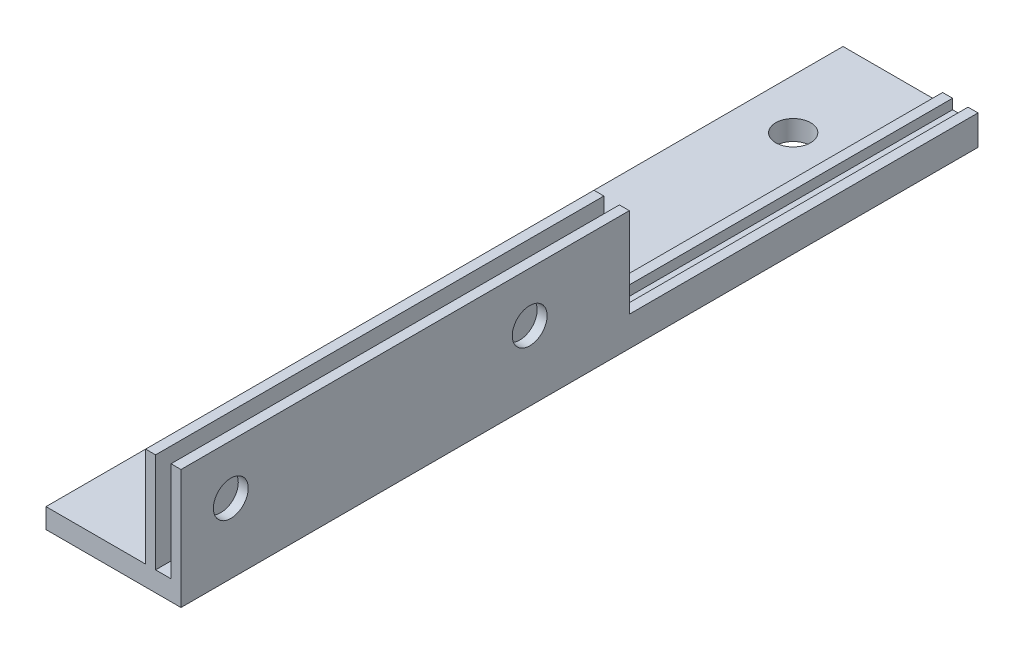
ISO-10303-21;
HEADER;
FILE_DESCRIPTION(('STEP AP214'),'2;1');
FILE_NAME('part.step','',(''),(''),'','','');
FILE_SCHEMA(('AUTOMOTIVE_DESIGN { 1 0 10303 214 1 1 1 1 }'));
ENDSEC;
DATA;
#1=APPLICATION_CONTEXT('core data for automotive mechanical design processes');
#2=APPLICATION_PROTOCOL_DEFINITION('international standard','automotive_design',2000,#1);
#3=PRODUCT_CONTEXT('',#1,'mechanical');
#4=PRODUCT('Part','Part','',(#3));
#5=PRODUCT_RELATED_PRODUCT_CATEGORY('part','',(#4));
#6=PRODUCT_DEFINITION_FORMATION('','',#4);
#7=PRODUCT_DEFINITION_CONTEXT('part definition',#1,'design');
#8=PRODUCT_DEFINITION('design','',#6,#7);
#9=PRODUCT_DEFINITION_SHAPE('','',#8);
#10=(LENGTH_UNIT() NAMED_UNIT(*) SI_UNIT(.MILLI.,.METRE.));
#11=(NAMED_UNIT(*) PLANE_ANGLE_UNIT() SI_UNIT($,.RADIAN.));
#12=(NAMED_UNIT(*) SI_UNIT($,.STERADIAN.) SOLID_ANGLE_UNIT());
#13=UNCERTAINTY_MEASURE_WITH_UNIT(LENGTH_MEASURE(1.E-05),#10,'distance_accuracy_value','');
#14=(GEOMETRIC_REPRESENTATION_CONTEXT(3) GLOBAL_UNCERTAINTY_ASSIGNED_CONTEXT((#13)) GLOBAL_UNIT_ASSIGNED_CONTEXT((#10,
#11,#12)) REPRESENTATION_CONTEXT('',''));
#15=CARTESIAN_POINT('',(0.,0.,0.));
#16=DIRECTION('',(0.,0.,1.));
#17=DIRECTION('',(1.,0.,0.));
#18=AXIS2_PLACEMENT_3D('',#15,#16,#17);
#19=CARTESIAN_POINT('',(0.,0.,0.));
#20=DIRECTION('',(0.,0.,-1.));
#21=DIRECTION('',(-1.,0.,0.));
#22=AXIS2_PLACEMENT_3D('',#19,#20,#21);
#23=PLANE('',#22);
#24=DIRECTION('',(0.,1.,0.));
#25=VECTOR('',#24,1.);
#26=CARTESIAN_POINT('',(13.55,0.,0.));
#27=LINE('',#26,#25);
#28=CARTESIAN_POINT('',(13.55,3.,0.));
#29=VERTEX_POINT('',#28);
#30=CARTESIAN_POINT('',(13.55,12.,0.));
#31=VERTEX_POINT('',#30);
#32=EDGE_CURVE('E145',#29,#31,#27,.T.);
#33=ORIENTED_EDGE('',*,*,#32,.F.);
#34=DIRECTION('',(-1.,0.,0.));
#35=VECTOR('',#34,1.);
#36=CARTESIAN_POINT('',(13.55,3.,0.));
#37=LINE('',#36,#35);
#38=CARTESIAN_POINT('',(12.55,3.,0.));
#39=VERTEX_POINT('',#38);
#40=EDGE_CURVE('E186',#29,#39,#37,.T.);
#41=ORIENTED_EDGE('',*,*,#40,.T.);
#42=DIRECTION('',(0.,-1.,0.));
#43=VECTOR('',#42,1.);
#44=CARTESIAN_POINT('',(12.55,12.,0.));
#45=LINE('',#44,#43);
#46=CARTESIAN_POINT('',(12.55,12.,0.));
#47=VERTEX_POINT('',#46);
#48=EDGE_CURVE('E149',#47,#39,#45,.T.);
#49=ORIENTED_EDGE('',*,*,#48,.F.);
#50=DIRECTION('',(-1.,0.,0.));
#51=VECTOR('',#50,1.);
#52=CARTESIAN_POINT('',(13.55,12.,0.));
#53=LINE('',#52,#51);
#54=EDGE_CURVE('E147',#31,#47,#53,.T.);
#55=ORIENTED_EDGE('',*,*,#54,.F.);
#56=EDGE_LOOP('',(#33,#41,#49,#55));
#57=FACE_BOUND('',#56,.T.);
#58=ADVANCED_FACE('F39',(#57),#23,.T.);
#59=DIRECTION('',(0.,1.,0.));
#60=VECTOR('',#59,1.);
#61=CARTESIAN_POINT('',(11.,2.,0.));
#62=LINE('',#61,#60);
#63=CARTESIAN_POINT('',(11.,3.,0.));
#64=VERTEX_POINT('',#63);
#65=CARTESIAN_POINT('',(11.,12.,0.));
#66=VERTEX_POINT('',#65);
#67=EDGE_CURVE('E152',#64,#66,#62,.T.);
#68=ORIENTED_EDGE('',*,*,#67,.F.);
#69=DIRECTION('',(-1.,0.,0.));
#70=VECTOR('',#69,1.);
#71=CARTESIAN_POINT('',(11.,3.,0.));
#72=LINE('',#71,#70);
#73=CARTESIAN_POINT('',(10.,3.,0.));
#74=VERTEX_POINT('',#73);
#75=EDGE_CURVE('E234',#64,#74,#72,.T.);
#76=ORIENTED_EDGE('',*,*,#75,.T.);
#77=DIRECTION('',(0.,-1.,0.));
#78=VECTOR('',#77,1.);
#79=CARTESIAN_POINT('',(10.,2.,0.));
#80=LINE('',#79,#78);
#81=CARTESIAN_POINT('',(10.,12.,0.));
#82=VERTEX_POINT('',#81);
#83=EDGE_CURVE('E155',#82,#74,#80,.T.);
#84=ORIENTED_EDGE('',*,*,#83,.F.);
#85=DIRECTION('',(-1.,0.,0.));
#86=VECTOR('',#85,1.);
#87=CARTESIAN_POINT('',(10.,12.,0.));
#88=LINE('',#87,#86);
#89=EDGE_CURVE('E85',#66,#82,#88,.T.);
#90=ORIENTED_EDGE('',*,*,#89,.F.);
#91=EDGE_LOOP('',(#68,#76,#84,#90));
#92=FACE_BOUND('',#91,.T.);
#93=ADVANCED_FACE('F283',(#92),#23,.T.);
#94=CARTESIAN_POINT('',(13.55,0.,45.));
#95=DIRECTION('',(0.,1.,0.));
#96=DIRECTION('',(0.,0.,1.));
#97=AXIS2_PLACEMENT_3D('',#94,#95,#96);
#98=PLANE('',#97);
#99=CARTESIAN_POINT('',(5.,0.,-25.));
#100=DIRECTION('',(0.,1.,0.));
#101=DIRECTION('',(0.,0.,1.));
#102=AXIS2_PLACEMENT_3D('',#99,#100,#101);
#103=CIRCLE('',#102,1.75000000000001);
#104=CARTESIAN_POINT('',(5.,0.,-23.25));
#105=VERTEX_POINT('',#104);
#106=EDGE_CURVE('E348',#105,#105,#103,.F.);
#107=ORIENTED_EDGE('',*,*,#106,.F.);
#108=EDGE_LOOP('',(#107));
#109=FACE_BOUND('',#108,.T.);
#110=CARTESIAN_POINT('',(5.00000000000001,0.,35.));
#111=DIRECTION('',(0.,1.,0.));
#112=DIRECTION('',(0.,0.,1.));
#113=AXIS2_PLACEMENT_3D('',#110,#111,#112);
#114=CIRCLE('',#113,1.75);
#115=CARTESIAN_POINT('',(5.00000000000001,0.,36.75));
#116=VERTEX_POINT('',#115);
#117=EDGE_CURVE('E399',#116,#116,#114,.F.);
#118=ORIENTED_EDGE('',*,*,#117,.F.);
#119=EDGE_LOOP('',(#118));
#120=FACE_BOUND('',#119,.T.);
#121=DIRECTION('',(0.,0.,-1.));
#122=VECTOR('',#121,1.);
#123=CARTESIAN_POINT('',(0.,0.,45.));
#124=LINE('',#123,#122);
#125=CARTESIAN_POINT('',(0.,0.,45.));
#126=VERTEX_POINT('',#125);
#127=CARTESIAN_POINT('',(0.,0.,-35.));
#128=VERTEX_POINT('',#127);
#129=EDGE_CURVE('E141',#126,#128,#124,.T.);
#130=ORIENTED_EDGE('',*,*,#129,.T.);
#131=DIRECTION('',(1.,0.,0.));
#132=VECTOR('',#131,1.);
#133=CARTESIAN_POINT('',(0.,0.,-35.));
#134=LINE('',#133,#132);
#135=CARTESIAN_POINT('',(13.55,0.,-35.));
#136=VERTEX_POINT('',#135);
#137=EDGE_CURVE('E232',#128,#136,#134,.T.);
#138=ORIENTED_EDGE('',*,*,#137,.T.);
#139=DIRECTION('',(0.,0.,-1.));
#140=VECTOR('',#139,1.);
#141=CARTESIAN_POINT('',(13.55,0.,45.));
#142=LINE('',#141,#140);
#143=CARTESIAN_POINT('',(13.55,0.,45.));
#144=VERTEX_POINT('',#143);
#145=EDGE_CURVE('E11',#144,#136,#142,.T.);
#146=ORIENTED_EDGE('',*,*,#145,.F.);
#147=DIRECTION('',(1.,0.,0.));
#148=VECTOR('',#147,1.);
#149=CARTESIAN_POINT('',(13.55,0.,45.));
#150=LINE('',#149,#148);
#151=EDGE_CURVE('E157',#126,#144,#150,.T.);
#152=ORIENTED_EDGE('',*,*,#151,.F.);
#153=EDGE_LOOP('',(#130,#138,#146,#152));
#154=FACE_BOUND('',#153,.T.);
#155=ADVANCED_FACE('F41',(#109,#120,#154),#98,.F.);
#156=CARTESIAN_POINT('',(13.55,0.,45.));
#157=DIRECTION('',(-1.,0.,0.));
#158=DIRECTION('',(0.,0.,1.));
#159=AXIS2_PLACEMENT_3D('',#156,#157,#158);
#160=PLANE('',#159);
#161=CARTESIAN_POINT('',(13.55,7.,40.));
#162=DIRECTION('',(-1.,0.,0.));
#163=DIRECTION('',(0.,0.,1.));
#164=AXIS2_PLACEMENT_3D('',#161,#162,#163);
#165=CIRCLE('',#164,1.75);
#166=CARTESIAN_POINT('',(13.55,7.,41.75));
#167=VERTEX_POINT('',#166);
#168=EDGE_CURVE('E342',#167,#167,#165,.T.);
#169=ORIENTED_EDGE('',*,*,#168,.T.);
#170=EDGE_LOOP('',(#169));
#171=FACE_BOUND('',#170,.T.);
#172=CARTESIAN_POINT('',(13.55,7.,10.));
#173=DIRECTION('',(-1.,0.,0.));
#174=DIRECTION('',(0.,0.,1.));
#175=AXIS2_PLACEMENT_3D('',#172,#173,#174);
#176=CIRCLE('',#175,1.75);
#177=CARTESIAN_POINT('',(13.55,7.,11.75));
#178=VERTEX_POINT('',#177);
#179=EDGE_CURVE('E345',#178,#178,#176,.T.);
#180=ORIENTED_EDGE('',*,*,#179,.T.);
#181=EDGE_LOOP('',(#180));
#182=FACE_BOUND('',#181,.T.);
#183=ORIENTED_EDGE('',*,*,#145,.T.);
#184=DIRECTION('',(0.,1.,0.));
#185=VECTOR('',#184,1.);
#186=CARTESIAN_POINT('',(13.55,0.,-35.));
#187=LINE('',#186,#185);
#188=CARTESIAN_POINT('',(13.55,3.,-35.));
#189=VERTEX_POINT('',#188);
#190=EDGE_CURVE('E242',#136,#189,#187,.T.);
#191=ORIENTED_EDGE('',*,*,#190,.T.);
#192=DIRECTION('',(0.,0.,1.));
#193=VECTOR('',#192,1.);
#194=CARTESIAN_POINT('',(13.55,3.,-35.));
#195=LINE('',#194,#193);
#196=EDGE_CURVE('E258',#189,#29,#195,.T.);
#197=ORIENTED_EDGE('',*,*,#196,.T.);
#198=ORIENTED_EDGE('',*,*,#32,.T.);
#199=DIRECTION('',(0.,0.,-1.));
#200=VECTOR('',#199,1.);
#201=CARTESIAN_POINT('',(13.55,12.,45.));
#202=LINE('',#201,#200);
#203=CARTESIAN_POINT('',(13.55,12.,45.));
#204=VERTEX_POINT('',#203);
#205=EDGE_CURVE('E47',#204,#31,#202,.T.);
#206=ORIENTED_EDGE('',*,*,#205,.F.);
#207=DIRECTION('',(0.,1.,0.));
#208=VECTOR('',#207,1.);
#209=CARTESIAN_POINT('',(13.55,0.,45.));
#210=LINE('',#209,#208);
#211=EDGE_CURVE('E93',#144,#204,#210,.T.);
#212=ORIENTED_EDGE('',*,*,#211,.F.);
#213=EDGE_LOOP('',(#183,#191,#197,#198,#206,#212));
#214=FACE_BOUND('',#213,.T.);
#215=ADVANCED_FACE('F295',(#171,#182,#214),#160,.F.);
#216=CARTESIAN_POINT('',(13.55,12.,45.));
#217=DIRECTION('',(0.,-1.,0.));
#218=DIRECTION('',(0.,0.,-1.));
#219=AXIS2_PLACEMENT_3D('',#216,#217,#218);
#220=PLANE('',#219);
#221=ORIENTED_EDGE('',*,*,#54,.T.);
#222=DIRECTION('',(0.,0.,-1.));
#223=VECTOR('',#222,1.);
#224=CARTESIAN_POINT('',(12.55,12.,45.));
#225=LINE('',#224,#223);
#226=CARTESIAN_POINT('',(12.55,12.,45.));
#227=VERTEX_POINT('',#226);
#228=EDGE_CURVE('E170',#227,#47,#225,.T.);
#229=ORIENTED_EDGE('',*,*,#228,.F.);
#230=DIRECTION('',(-1.,0.,0.));
#231=VECTOR('',#230,1.);
#232=CARTESIAN_POINT('',(13.55,12.,45.));
#233=LINE('',#232,#231);
#234=EDGE_CURVE('E178',#204,#227,#233,.T.);
#235=ORIENTED_EDGE('',*,*,#234,.F.);
#236=ORIENTED_EDGE('',*,*,#205,.T.);
#237=EDGE_LOOP('',(#221,#229,#235,#236));
#238=FACE_BOUND('',#237,.T.);
#239=ADVANCED_FACE('F176',(#238),#220,.F.);
#240=CARTESIAN_POINT('',(12.55,12.,45.));
#241=DIRECTION('',(1.,0.,0.));
#242=DIRECTION('',(0.,0.,-1.));
#243=AXIS2_PLACEMENT_3D('',#240,#241,#242);
#244=PLANE('',#243);
#245=CARTESIAN_POINT('',(12.55,7.,40.));
#246=DIRECTION('',(1.,0.,0.));
#247=DIRECTION('',(0.,0.,-1.));
#248=AXIS2_PLACEMENT_3D('',#245,#246,#247);
#249=CIRCLE('',#248,1.75);
#250=CARTESIAN_POINT('',(12.55,7.,38.25));
#251=VERTEX_POINT('',#250);
#252=EDGE_CURVE('E238',#251,#251,#249,.T.);
#253=ORIENTED_EDGE('',*,*,#252,.T.);
#254=EDGE_LOOP('',(#253));
#255=FACE_BOUND('',#254,.T.);
#256=CARTESIAN_POINT('',(12.55,7.,10.));
#257=DIRECTION('',(1.,0.,0.));
#258=DIRECTION('',(0.,0.,-1.));
#259=AXIS2_PLACEMENT_3D('',#256,#257,#258);
#260=CIRCLE('',#259,1.75);
#261=CARTESIAN_POINT('',(12.55,7.,8.25));
#262=VERTEX_POINT('',#261);
#263=EDGE_CURVE('E361',#262,#262,#260,.T.);
#264=ORIENTED_EDGE('',*,*,#263,.T.);
#265=EDGE_LOOP('',(#264));
#266=FACE_BOUND('',#265,.T.);
#267=ORIENTED_EDGE('',*,*,#48,.T.);
#268=DIRECTION('',(0.,0.,1.));
#269=VECTOR('',#268,1.);
#270=CARTESIAN_POINT('',(12.55,3.,-35.));
#271=LINE('',#270,#269);
#272=CARTESIAN_POINT('',(12.55,3.,-35.));
#273=VERTEX_POINT('',#272);
#274=EDGE_CURVE('E193',#273,#39,#271,.T.);
#275=ORIENTED_EDGE('',*,*,#274,.F.);
#276=DIRECTION('',(0.,-1.,0.));
#277=VECTOR('',#276,1.);
#278=CARTESIAN_POINT('',(12.55,3.,-35.));
#279=LINE('',#278,#277);
#280=CARTESIAN_POINT('',(12.55,2.,-35.));
#281=VERTEX_POINT('',#280);
#282=EDGE_CURVE('E247',#273,#281,#279,.T.);
#283=ORIENTED_EDGE('',*,*,#282,.T.);
#284=DIRECTION('',(0.,0.,-1.));
#285=VECTOR('',#284,1.);
#286=CARTESIAN_POINT('',(12.55,2.,45.));
#287=LINE('',#286,#285);
#288=CARTESIAN_POINT('',(12.55,2.,45.));
#289=VERTEX_POINT('',#288);
#290=EDGE_CURVE('E167',#289,#281,#287,.T.);
#291=ORIENTED_EDGE('',*,*,#290,.F.);
#292=DIRECTION('',(0.,-1.,0.));
#293=VECTOR('',#292,1.);
#294=CARTESIAN_POINT('',(12.55,12.,45.));
#295=LINE('',#294,#293);
#296=EDGE_CURVE('E268',#227,#289,#295,.T.);
#297=ORIENTED_EDGE('',*,*,#296,.F.);
#298=ORIENTED_EDGE('',*,*,#228,.T.);
#299=EDGE_LOOP('',(#267,#275,#283,#291,#297,#298));
#300=FACE_BOUND('',#299,.T.);
#301=ADVANCED_FACE('F189',(#255,#266,#300),#244,.F.);
#302=CARTESIAN_POINT('',(12.55,2.,45.));
#303=DIRECTION('',(0.,-1.,0.));
#304=DIRECTION('',(0.,0.,-1.));
#305=AXIS2_PLACEMENT_3D('',#302,#303,#304);
#306=PLANE('',#305);
#307=ORIENTED_EDGE('',*,*,#290,.T.);
#308=DIRECTION('',(-1.,0.,0.));
#309=VECTOR('',#308,1.);
#310=CARTESIAN_POINT('',(12.55,2.,-35.));
#311=LINE('',#310,#309);
#312=CARTESIAN_POINT('',(11.,2.,-35.));
#313=VERTEX_POINT('',#312);
#314=EDGE_CURVE('E249',#281,#313,#311,.T.);
#315=ORIENTED_EDGE('',*,*,#314,.T.);
#316=DIRECTION('',(0.,0.,-1.));
#317=VECTOR('',#316,1.);
#318=CARTESIAN_POINT('',(11.,2.,45.));
#319=LINE('',#318,#317);
#320=CARTESIAN_POINT('',(11.,2.,45.));
#321=VERTEX_POINT('',#320);
#322=EDGE_CURVE('E164',#321,#313,#319,.T.);
#323=ORIENTED_EDGE('',*,*,#322,.F.);
#324=DIRECTION('',(-1.,0.,0.));
#325=VECTOR('',#324,1.);
#326=CARTESIAN_POINT('',(12.55,2.,45.));
#327=LINE('',#326,#325);
#328=EDGE_CURVE('E270',#289,#321,#327,.T.);
#329=ORIENTED_EDGE('',*,*,#328,.F.);
#330=EDGE_LOOP('',(#307,#315,#323,#329));
#331=FACE_BOUND('',#330,.T.);
#332=ADVANCED_FACE('F289',(#331),#306,.F.);
#333=CARTESIAN_POINT('',(11.,2.,45.));
#334=DIRECTION('',(-1.,0.,0.));
#335=DIRECTION('',(0.,0.,1.));
#336=AXIS2_PLACEMENT_3D('',#333,#334,#335);
#337=PLANE('',#336);
#338=CARTESIAN_POINT('',(11.,7.,40.));
#339=DIRECTION('',(-1.,0.,0.));
#340=DIRECTION('',(0.,0.,1.));
#341=AXIS2_PLACEMENT_3D('',#338,#339,#340);
#342=CIRCLE('',#341,1.75);
#343=CARTESIAN_POINT('',(11.,7.,41.75));
#344=VERTEX_POINT('',#343);
#345=EDGE_CURVE('E363',#344,#344,#342,.T.);
#346=ORIENTED_EDGE('',*,*,#345,.T.);
#347=EDGE_LOOP('',(#346));
#348=FACE_BOUND('',#347,.T.);
#349=CARTESIAN_POINT('',(11.,7.,10.));
#350=DIRECTION('',(-1.,0.,0.));
#351=DIRECTION('',(0.,0.,1.));
#352=AXIS2_PLACEMENT_3D('',#349,#350,#351);
#353=CIRCLE('',#352,1.75);
#354=CARTESIAN_POINT('',(11.,7.,11.75));
#355=VERTEX_POINT('',#354);
#356=EDGE_CURVE('E358',#355,#355,#353,.T.);
#357=ORIENTED_EDGE('',*,*,#356,.T.);
#358=EDGE_LOOP('',(#357));
#359=FACE_BOUND('',#358,.T.);
#360=ORIENTED_EDGE('',*,*,#322,.T.);
#361=DIRECTION('',(0.,1.,0.));
#362=VECTOR('',#361,1.);
#363=CARTESIAN_POINT('',(11.,2.,-35.));
#364=LINE('',#363,#362);
#365=CARTESIAN_POINT('',(11.,3.,-35.));
#366=VERTEX_POINT('',#365);
#367=EDGE_CURVE('E252',#313,#366,#364,.T.);
#368=ORIENTED_EDGE('',*,*,#367,.T.);
#369=DIRECTION('',(0.,0.,1.));
#370=VECTOR('',#369,1.);
#371=CARTESIAN_POINT('',(11.,3.,-35.));
#372=LINE('',#371,#370);
#373=EDGE_CURVE('E261',#366,#64,#372,.T.);
#374=ORIENTED_EDGE('',*,*,#373,.T.);
#375=ORIENTED_EDGE('',*,*,#67,.T.);
#376=DIRECTION('',(0.,0.,-1.));
#377=VECTOR('',#376,1.);
#378=CARTESIAN_POINT('',(11.,12.,45.));
#379=LINE('',#378,#377);
#380=CARTESIAN_POINT('',(11.,12.,45.));
#381=VERTEX_POINT('',#380);
#382=EDGE_CURVE('E162',#381,#66,#379,.T.);
#383=ORIENTED_EDGE('',*,*,#382,.F.);
#384=DIRECTION('',(0.,1.,0.));
#385=VECTOR('',#384,1.);
#386=CARTESIAN_POINT('',(11.,2.,45.));
#387=LINE('',#386,#385);
#388=EDGE_CURVE('E272',#321,#381,#387,.T.);
#389=ORIENTED_EDGE('',*,*,#388,.F.);
#390=EDGE_LOOP('',(#360,#368,#374,#375,#383,#389));
#391=FACE_BOUND('',#390,.T.);
#392=ADVANCED_FACE('F278',(#348,#359,#391),#337,.F.);
#393=CARTESIAN_POINT('',(10.,12.,45.));
#394=DIRECTION('',(0.,-1.,0.));
#395=DIRECTION('',(0.,0.,-1.));
#396=AXIS2_PLACEMENT_3D('',#393,#394,#395);
#397=PLANE('',#396);
#398=ORIENTED_EDGE('',*,*,#89,.T.);
#399=DIRECTION('',(0.,0.,-1.));
#400=VECTOR('',#399,1.);
#401=CARTESIAN_POINT('',(10.,12.,45.));
#402=LINE('',#401,#400);
#403=CARTESIAN_POINT('',(10.,12.,45.));
#404=VERTEX_POINT('',#403);
#405=EDGE_CURVE('E135',#404,#82,#402,.T.);
#406=ORIENTED_EDGE('',*,*,#405,.F.);
#407=DIRECTION('',(-1.,0.,0.));
#408=VECTOR('',#407,1.);
#409=CARTESIAN_POINT('',(10.,12.,45.));
#410=LINE('',#409,#408);
#411=EDGE_CURVE('E122',#381,#404,#410,.T.);
#412=ORIENTED_EDGE('',*,*,#411,.F.);
#413=ORIENTED_EDGE('',*,*,#382,.T.);
#414=EDGE_LOOP('',(#398,#406,#412,#413));
#415=FACE_BOUND('',#414,.T.);
#416=ADVANCED_FACE('F280',(#415),#397,.F.);
#417=CARTESIAN_POINT('',(10.,2.,45.));
#418=DIRECTION('',(1.,0.,0.));
#419=DIRECTION('',(0.,0.,-1.));
#420=AXIS2_PLACEMENT_3D('',#417,#418,#419);
#421=PLANE('',#420);
#422=CARTESIAN_POINT('',(10.,7.,40.));
#423=DIRECTION('',(-1.,0.,0.));
#424=DIRECTION('',(0.,0.,1.));
#425=AXIS2_PLACEMENT_3D('',#422,#423,#424);
#426=CIRCLE('',#425,1.75);
#427=CARTESIAN_POINT('',(10.,7.,41.75));
#428=VERTEX_POINT('',#427);
#429=EDGE_CURVE('E351',#428,#428,#426,.T.);
#430=ORIENTED_EDGE('',*,*,#429,.F.);
#431=EDGE_LOOP('',(#430));
#432=FACE_BOUND('',#431,.T.);
#433=CARTESIAN_POINT('',(10.,7.,10.));
#434=DIRECTION('',(-1.,0.,0.));
#435=DIRECTION('',(0.,0.,1.));
#436=AXIS2_PLACEMENT_3D('',#433,#434,#435);
#437=CIRCLE('',#436,1.75);
#438=CARTESIAN_POINT('',(10.,7.,11.75));
#439=VERTEX_POINT('',#438);
#440=EDGE_CURVE('E347',#439,#439,#437,.T.);
#441=ORIENTED_EDGE('',*,*,#440,.F.);
#442=EDGE_LOOP('',(#441));
#443=FACE_BOUND('',#442,.T.);
#444=ORIENTED_EDGE('',*,*,#83,.T.);
#445=DIRECTION('',(0.,0.,1.));
#446=VECTOR('',#445,1.);
#447=CARTESIAN_POINT('',(10.,3.,-35.));
#448=LINE('',#447,#446);
#449=CARTESIAN_POINT('',(10.,3.,-35.));
#450=VERTEX_POINT('',#449);
#451=EDGE_CURVE('E54',#450,#74,#448,.T.);
#452=ORIENTED_EDGE('',*,*,#451,.F.);
#453=DIRECTION('',(0.,-1.,0.));
#454=VECTOR('',#453,1.);
#455=CARTESIAN_POINT('',(10.,3.,-35.));
#456=LINE('',#455,#454);
#457=CARTESIAN_POINT('',(10.,2.,-35.));
#458=VERTEX_POINT('',#457);
#459=EDGE_CURVE('E131',#450,#458,#456,.T.);
#460=ORIENTED_EDGE('',*,*,#459,.T.);
#461=DIRECTION('',(0.,0.,-1.));
#462=VECTOR('',#461,1.);
#463=CARTESIAN_POINT('',(10.,2.,45.));
#464=LINE('',#463,#462);
#465=CARTESIAN_POINT('',(10.,2.,45.));
#466=VERTEX_POINT('',#465);
#467=EDGE_CURVE('E127',#466,#458,#464,.T.);
#468=ORIENTED_EDGE('',*,*,#467,.F.);
#469=DIRECTION('',(0.,-1.,0.));
#470=VECTOR('',#469,1.);
#471=CARTESIAN_POINT('',(10.,2.,45.));
#472=LINE('',#471,#470);
#473=EDGE_CURVE('E115',#404,#466,#472,.T.);
#474=ORIENTED_EDGE('',*,*,#473,.F.);
#475=ORIENTED_EDGE('',*,*,#405,.T.);
#476=EDGE_LOOP('',(#444,#452,#460,#468,#474,#475));
#477=FACE_BOUND('',#476,.T.);
#478=ADVANCED_FACE('F129',(#432,#443,#477),#421,.F.);
#479=CARTESIAN_POINT('',(0.,2.,45.));
#480=DIRECTION('',(0.,-1.,0.));
#481=DIRECTION('',(0.,0.,-1.));
#482=AXIS2_PLACEMENT_3D('',#479,#480,#481);
#483=PLANE('',#482);
#484=CARTESIAN_POINT('',(5.,2.,-25.));
#485=DIRECTION('',(0.,1.,0.));
#486=DIRECTION('',(0.,0.,1.));
#487=AXIS2_PLACEMENT_3D('',#484,#485,#486);
#488=CIRCLE('',#487,1.75000000000001);
#489=CARTESIAN_POINT('',(5.,2.,-23.25));
#490=VERTEX_POINT('',#489);
#491=EDGE_CURVE('E354',#490,#490,#488,.T.);
#492=ORIENTED_EDGE('',*,*,#491,.F.);
#493=EDGE_LOOP('',(#492));
#494=FACE_BOUND('',#493,.T.);
#495=CARTESIAN_POINT('',(5.00000000000001,2.,35.));
#496=DIRECTION('',(0.,1.,0.));
#497=DIRECTION('',(0.,0.,1.));
#498=AXIS2_PLACEMENT_3D('',#495,#496,#497);
#499=CIRCLE('',#498,1.75);
#500=CARTESIAN_POINT('',(5.00000000000001,2.,36.75));
#501=VERTEX_POINT('',#500);
#502=EDGE_CURVE('E396',#501,#501,#499,.T.);
#503=ORIENTED_EDGE('',*,*,#502,.F.);
#504=EDGE_LOOP('',(#503));
#505=FACE_BOUND('',#504,.T.);
#506=ORIENTED_EDGE('',*,*,#467,.T.);
#507=DIRECTION('',(-1.,0.,0.));
#508=VECTOR('',#507,1.);
#509=CARTESIAN_POINT('',(10.,2.,-35.));
#510=LINE('',#509,#508);
#511=CARTESIAN_POINT('',(0.,2.,-35.));
#512=VERTEX_POINT('',#511);
#513=EDGE_CURVE('E229',#458,#512,#510,.T.);
#514=ORIENTED_EDGE('',*,*,#513,.T.);
#515=DIRECTION('',(0.,0.,-1.));
#516=VECTOR('',#515,1.);
#517=CARTESIAN_POINT('',(0.,2.,45.));
#518=LINE('',#517,#516);
#519=CARTESIAN_POINT('',(0.,2.,45.));
#520=VERTEX_POINT('',#519);
#521=EDGE_CURVE('E136',#520,#512,#518,.T.);
#522=ORIENTED_EDGE('',*,*,#521,.F.);
#523=DIRECTION('',(-1.,0.,0.));
#524=VECTOR('',#523,1.);
#525=CARTESIAN_POINT('',(0.,2.,45.));
#526=LINE('',#525,#524);
#527=EDGE_CURVE('E119',#466,#520,#526,.T.);
#528=ORIENTED_EDGE('',*,*,#527,.F.);
#529=EDGE_LOOP('',(#506,#514,#522,#528));
#530=FACE_BOUND('',#529,.T.);
#531=ADVANCED_FACE('F138',(#494,#505,#530),#483,.F.);
#532=CARTESIAN_POINT('',(0.,0.,45.));
#533=DIRECTION('',(1.,0.,0.));
#534=DIRECTION('',(0.,0.,-1.));
#535=AXIS2_PLACEMENT_3D('',#532,#533,#534);
#536=PLANE('',#535);
#537=ORIENTED_EDGE('',*,*,#521,.T.);
#538=DIRECTION('',(0.,-1.,0.));
#539=VECTOR('',#538,1.);
#540=CARTESIAN_POINT('',(0.,2.,-35.));
#541=LINE('',#540,#539);
#542=EDGE_CURVE('E225',#512,#128,#541,.T.);
#543=ORIENTED_EDGE('',*,*,#542,.T.);
#544=ORIENTED_EDGE('',*,*,#129,.F.);
#545=DIRECTION('',(0.,-1.,0.));
#546=VECTOR('',#545,1.);
#547=CARTESIAN_POINT('',(0.,0.,45.));
#548=LINE('',#547,#546);
#549=EDGE_CURVE('E63',#520,#126,#548,.T.);
#550=ORIENTED_EDGE('',*,*,#549,.F.);
#551=EDGE_LOOP('',(#537,#543,#544,#550));
#552=FACE_BOUND('',#551,.T.);
#553=ADVANCED_FACE('F224',(#552),#536,.F.);
#554=CARTESIAN_POINT('',(0.,0.,45.));
#555=DIRECTION('',(0.,0.,-1.));
#556=DIRECTION('',(-1.,0.,0.));
#557=AXIS2_PLACEMENT_3D('',#554,#555,#556);
#558=PLANE('',#557);
#559=ORIENTED_EDGE('',*,*,#151,.T.);
#560=ORIENTED_EDGE('',*,*,#211,.T.);
#561=ORIENTED_EDGE('',*,*,#234,.T.);
#562=ORIENTED_EDGE('',*,*,#296,.T.);
#563=ORIENTED_EDGE('',*,*,#328,.T.);
#564=ORIENTED_EDGE('',*,*,#388,.T.);
#565=ORIENTED_EDGE('',*,*,#411,.T.);
#566=ORIENTED_EDGE('',*,*,#473,.T.);
#567=ORIENTED_EDGE('',*,*,#527,.T.);
#568=ORIENTED_EDGE('',*,*,#549,.T.);
#569=EDGE_LOOP('',(#559,#560,#561,#562,#563,#564,#565,#566,#567,#568));
#570=FACE_BOUND('',#569,.T.);
#571=ADVANCED_FACE('F117',(#570),#558,.F.);
#572=CARTESIAN_POINT('',(11.,3.,-35.));
#573=DIRECTION('',(0.,1.,0.));
#574=DIRECTION('',(-1.,0.,0.));
#575=AXIS2_PLACEMENT_3D('',#572,#573,#574);
#576=PLANE('',#575);
#577=ORIENTED_EDGE('',*,*,#75,.F.);
#578=ORIENTED_EDGE('',*,*,#373,.F.);
#579=DIRECTION('',(-1.,0.,0.));
#580=VECTOR('',#579,1.);
#581=CARTESIAN_POINT('',(11.,3.,-35.));
#582=LINE('',#581,#580);
#583=EDGE_CURVE('E255',#366,#450,#582,.T.);
#584=ORIENTED_EDGE('',*,*,#583,.T.);
#585=ORIENTED_EDGE('',*,*,#451,.T.);
#586=EDGE_LOOP('',(#577,#578,#584,#585));
#587=FACE_BOUND('',#586,.T.);
#588=ADVANCED_FACE('F284',(#587),#576,.T.);
#589=CARTESIAN_POINT('',(13.55,3.,-35.));
#590=DIRECTION('',(0.,1.,0.));
#591=DIRECTION('',(-1.,0.,0.));
#592=AXIS2_PLACEMENT_3D('',#589,#590,#591);
#593=PLANE('',#592);
#594=ORIENTED_EDGE('',*,*,#40,.F.);
#595=ORIENTED_EDGE('',*,*,#196,.F.);
#596=DIRECTION('',(-1.,0.,0.));
#597=VECTOR('',#596,1.);
#598=CARTESIAN_POINT('',(13.55,3.,-35.));
#599=LINE('',#598,#597);
#600=EDGE_CURVE('E245',#189,#273,#599,.T.);
#601=ORIENTED_EDGE('',*,*,#600,.T.);
#602=ORIENTED_EDGE('',*,*,#274,.T.);
#603=EDGE_LOOP('',(#594,#595,#601,#602));
#604=FACE_BOUND('',#603,.T.);
#605=ADVANCED_FACE('F296',(#604),#593,.T.);
#606=CARTESIAN_POINT('',(0.,0.,-35.));
#607=DIRECTION('',(0.,0.,1.));
#608=DIRECTION('',(1.,0.,0.));
#609=AXIS2_PLACEMENT_3D('',#606,#607,#608);
#610=PLANE('',#609);
#611=ORIENTED_EDGE('',*,*,#513,.F.);
#612=ORIENTED_EDGE('',*,*,#459,.F.);
#613=ORIENTED_EDGE('',*,*,#583,.F.);
#614=ORIENTED_EDGE('',*,*,#367,.F.);
#615=ORIENTED_EDGE('',*,*,#314,.F.);
#616=ORIENTED_EDGE('',*,*,#282,.F.);
#617=ORIENTED_EDGE('',*,*,#600,.F.);
#618=ORIENTED_EDGE('',*,*,#190,.F.);
#619=ORIENTED_EDGE('',*,*,#137,.F.);
#620=ORIENTED_EDGE('',*,*,#542,.F.);
#621=EDGE_LOOP('',(#611,#612,#613,#614,#615,#616,#617,#618,#619,#620));
#622=FACE_BOUND('',#621,.T.);
#623=ADVANCED_FACE('F228',(#622),#610,.F.);
#624=CARTESIAN_POINT('',(13.55,7.,10.));
#625=DIRECTION('',(-1.,0.,0.));
#626=DIRECTION('',(0.,0.,1.));
#627=AXIS2_PLACEMENT_3D('',#624,#625,#626);
#628=CYLINDRICAL_SURFACE('',#627,1.75);
#629=ORIENTED_EDGE('',*,*,#440,.T.);
#630=EDGE_LOOP('',(#629));
#631=FACE_BOUND('',#630,.T.);
#632=ORIENTED_EDGE('',*,*,#356,.F.);
#633=EDGE_LOOP('',(#632));
#634=FACE_BOUND('',#633,.T.);
#635=ADVANCED_FACE('F303',(#631,#634),#628,.F.);
#636=CARTESIAN_POINT('',(13.55,7.,40.));
#637=DIRECTION('',(-1.,0.,0.));
#638=DIRECTION('',(0.,0.,1.));
#639=AXIS2_PLACEMENT_3D('',#636,#637,#638);
#640=CYLINDRICAL_SURFACE('',#639,1.75);
#641=ORIENTED_EDGE('',*,*,#429,.T.);
#642=EDGE_LOOP('',(#641));
#643=FACE_BOUND('',#642,.T.);
#644=ORIENTED_EDGE('',*,*,#345,.F.);
#645=EDGE_LOOP('',(#644));
#646=FACE_BOUND('',#645,.T.);
#647=ADVANCED_FACE('F376',(#643,#646),#640,.F.);
#648=ORIENTED_EDGE('',*,*,#179,.F.);
#649=EDGE_LOOP('',(#648));
#650=FACE_BOUND('',#649,.T.);
#651=ORIENTED_EDGE('',*,*,#263,.F.);
#652=EDGE_LOOP('',(#651));
#653=FACE_BOUND('',#652,.T.);
#654=ADVANCED_FACE('F373',(#650,#653),#628,.F.);
#655=ORIENTED_EDGE('',*,*,#168,.F.);
#656=EDGE_LOOP('',(#655));
#657=FACE_BOUND('',#656,.T.);
#658=ORIENTED_EDGE('',*,*,#252,.F.);
#659=EDGE_LOOP('',(#658));
#660=FACE_BOUND('',#659,.T.);
#661=ADVANCED_FACE('F370',(#657,#660),#640,.F.);
#662=CARTESIAN_POINT('',(5.00000000000001,-0.00100000000000013,35.));
#663=DIRECTION('',(0.,1.,0.));
#664=DIRECTION('',(0.,0.,1.));
#665=AXIS2_PLACEMENT_3D('',#662,#663,#664);
#666=CYLINDRICAL_SURFACE('',#665,1.75);
#667=ORIENTED_EDGE('',*,*,#502,.T.);
#668=EDGE_LOOP('',(#667));
#669=FACE_BOUND('',#668,.T.);
#670=ORIENTED_EDGE('',*,*,#117,.T.);
#671=EDGE_LOOP('',(#670));
#672=FACE_BOUND('',#671,.T.);
#673=ADVANCED_FACE('F372',(#669,#672),#666,.F.);
#674=CARTESIAN_POINT('',(5.,-0.00100000000000013,-25.));
#675=DIRECTION('',(0.,1.,0.));
#676=DIRECTION('',(0.,0.,1.));
#677=AXIS2_PLACEMENT_3D('',#674,#675,#676);
#678=CYLINDRICAL_SURFACE('',#677,1.75000000000001);
#679=ORIENTED_EDGE('',*,*,#491,.T.);
#680=EDGE_LOOP('',(#679));
#681=FACE_BOUND('',#680,.T.);
#682=ORIENTED_EDGE('',*,*,#106,.T.);
#683=EDGE_LOOP('',(#682));
#684=FACE_BOUND('',#683,.T.);
#685=ADVANCED_FACE('F381',(#681,#684),#678,.F.);
#686=CLOSED_SHELL('',(#58,#93,#155,#215,#239,#301,#332,#392,#416,#478,#531,#553,#571,#588,#605,
#623,#635,#647,#654,#661,#673,#685));
#687=MANIFOLD_SOLID_BREP('B2',#686);
#688=ADVANCED_BREP_SHAPE_REPRESENTATION('',(#18,#687),#14);
#689=SHAPE_DEFINITION_REPRESENTATION(#9,#688);
ENDSEC;
END-ISO-10303-21;
